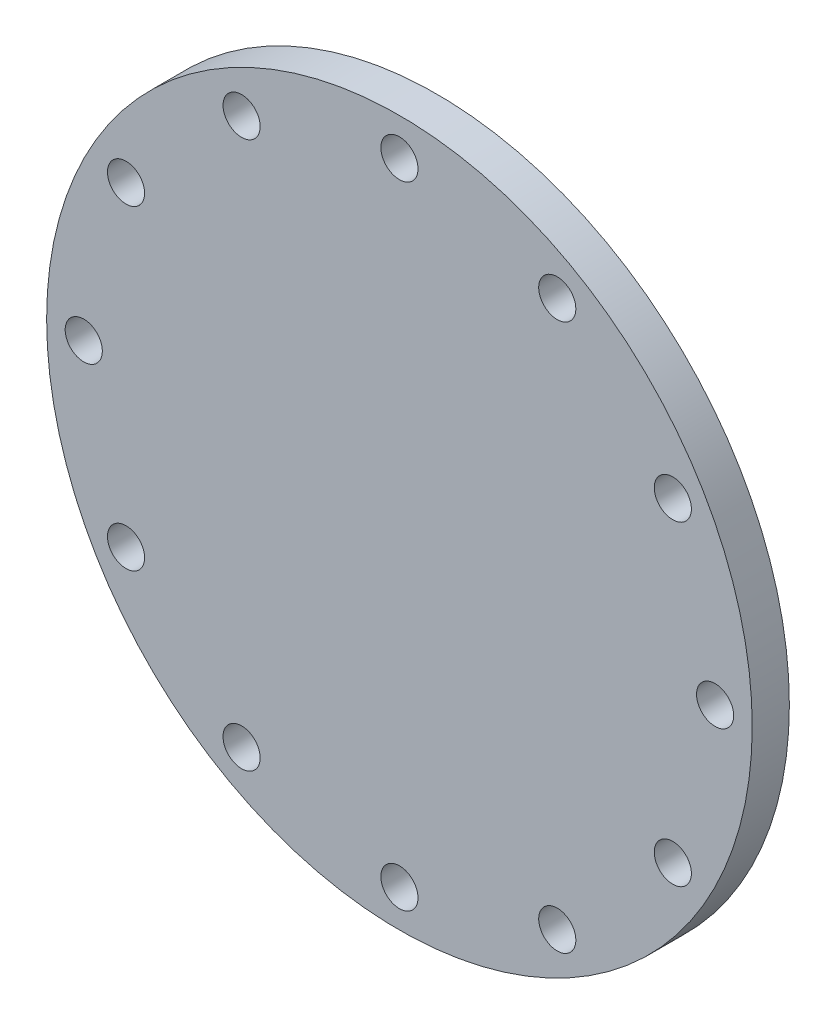
ISO-10303-21;
HEADER;
FILE_DESCRIPTION(('STEP AP214'),'2;1');
FILE_NAME('part.step','',(''),(''),'','','');
FILE_SCHEMA(('AUTOMOTIVE_DESIGN { 1 0 10303 214 1 1 1 1 }'));
ENDSEC;
DATA;
#1=APPLICATION_CONTEXT('core data for automotive mechanical design processes');
#2=APPLICATION_PROTOCOL_DEFINITION('international standard','automotive_design',2000,#1);
#3=PRODUCT_CONTEXT('',#1,'mechanical');
#4=PRODUCT('Part','Part','',(#3));
#5=PRODUCT_RELATED_PRODUCT_CATEGORY('part','',(#4));
#6=PRODUCT_DEFINITION_FORMATION('','',#4);
#7=PRODUCT_DEFINITION_CONTEXT('part definition',#1,'design');
#8=PRODUCT_DEFINITION('design','',#6,#7);
#9=PRODUCT_DEFINITION_SHAPE('','',#8);
#10=(LENGTH_UNIT() NAMED_UNIT(*) SI_UNIT(.MILLI.,.METRE.));
#11=(NAMED_UNIT(*) PLANE_ANGLE_UNIT() SI_UNIT($,.RADIAN.));
#12=(NAMED_UNIT(*) SI_UNIT($,.STERADIAN.) SOLID_ANGLE_UNIT());
#13=UNCERTAINTY_MEASURE_WITH_UNIT(LENGTH_MEASURE(1.E-05),#10,'distance_accuracy_value','');
#14=(GEOMETRIC_REPRESENTATION_CONTEXT(3) GLOBAL_UNCERTAINTY_ASSIGNED_CONTEXT((#13)) GLOBAL_UNIT_ASSIGNED_CONTEXT((#10,
#11,#12)) REPRESENTATION_CONTEXT('',''));
#15=CARTESIAN_POINT('',(0.,0.,0.));
#16=DIRECTION('',(0.,0.,1.));
#17=DIRECTION('',(1.,0.,0.));
#18=AXIS2_PLACEMENT_3D('',#15,#16,#17);
#19=CARTESIAN_POINT('',(0.,0.,25.4));
#20=DIRECTION('',(0.,0.,1.));
#21=DIRECTION('',(1.,0.,0.));
#22=AXIS2_PLACEMENT_3D('',#19,#20,#21);
#23=PLANE('',#22);
#24=CARTESIAN_POINT('',(-186.974884677056,107.949999999992,25.4));
#25=DIRECTION('',(0.,0.,1.));
#26=DIRECTION('',(1.,0.,0.));
#27=AXIS2_PLACEMENT_3D('',#24,#25,#26);
#28=CIRCLE('',#27,12.7000000000093);
#29=CARTESIAN_POINT('',(-174.274884677047,107.949999999992,25.4));
#30=VERTEX_POINT('',#29);
#31=EDGE_CURVE('E103',#30,#30,#28,.T.);
#32=ORIENTED_EDGE('',*,*,#31,.F.);
#33=EDGE_LOOP('',(#32));
#34=FACE_BOUND('',#33,.T.);
#35=CARTESIAN_POINT('',(-186.974884677047,-107.950000000008,25.4));
#36=DIRECTION('',(0.,0.,1.));
#37=DIRECTION('',(1.,0.,0.));
#38=AXIS2_PLACEMENT_3D('',#35,#36,#37);
#39=CIRCLE('',#38,12.7000000000175);
#40=CARTESIAN_POINT('',(-174.274884677029,-107.950000000008,25.4));
#41=VERTEX_POINT('',#40);
#42=EDGE_CURVE('E91',#41,#41,#39,.T.);
#43=ORIENTED_EDGE('',*,*,#42,.F.);
#44=EDGE_LOOP('',(#43));
#45=FACE_BOUND('',#44,.T.);
#46=CARTESIAN_POINT('',(1.83294208248919E-11,-215.9,25.4));
#47=DIRECTION('',(0.,0.,1.));
#48=DIRECTION('',(1.,0.,0.));
#49=AXIS2_PLACEMENT_3D('',#46,#47,#48);
#50=CIRCLE('',#49,12.700000000019);
#51=CARTESIAN_POINT('',(12.7000000000373,-215.9,25.4));
#52=VERTEX_POINT('',#51);
#53=EDGE_CURVE('E79',#52,#52,#50,.T.);
#54=ORIENTED_EDGE('',*,*,#53,.F.);
#55=EDGE_LOOP('',(#54));
#56=FACE_BOUND('',#55,.T.);
#57=CARTESIAN_POINT('',(186.974884677074,-107.949999999992,25.4));
#58=DIRECTION('',(0.,0.,1.));
#59=DIRECTION('',(1.,0.,0.));
#60=AXIS2_PLACEMENT_3D('',#57,#58,#59);
#61=CIRCLE('',#60,12.7000000000118);
#62=CARTESIAN_POINT('',(199.674884677086,-107.949999999992,25.4));
#63=VERTEX_POINT('',#62);
#64=EDGE_CURVE('E67',#63,#63,#61,.T.);
#65=ORIENTED_EDGE('',*,*,#64,.F.);
#66=EDGE_LOOP('',(#65));
#67=FACE_BOUND('',#66,.T.);
#68=CARTESIAN_POINT('',(186.974884677065,107.950000000008,25.4));
#69=DIRECTION('',(0.,0.,1.));
#70=DIRECTION('',(1.,0.,0.));
#71=AXIS2_PLACEMENT_3D('',#68,#69,#70);
#72=CIRCLE('',#71,12.7000000000025);
#73=CARTESIAN_POINT('',(199.674884677067,107.950000000008,25.4));
#74=VERTEX_POINT('',#73);
#75=EDGE_CURVE('E55',#74,#74,#72,.T.);
#76=ORIENTED_EDGE('',*,*,#75,.F.);
#77=EDGE_LOOP('',(#76));
#78=FACE_BOUND('',#77,.T.);
#79=CARTESIAN_POINT('',(0.,215.9,25.4));
#80=DIRECTION('',(0.,0.,1.));
#81=DIRECTION('',(1.,0.,0.));
#82=AXIS2_PLACEMENT_3D('',#79,#80,#81);
#83=CIRCLE('',#82,12.7);
#84=CARTESIAN_POINT('',(12.7,215.9,25.4));
#85=VERTEX_POINT('',#84);
#86=EDGE_CURVE('E44',#85,#85,#83,.T.);
#87=ORIENTED_EDGE('',*,*,#86,.F.);
#88=EDGE_LOOP('',(#87));
#89=FACE_BOUND('',#88,.T.);
#90=CARTESIAN_POINT('',(0.,0.,25.4));
#91=DIRECTION('',(0.,0.,1.));
#92=DIRECTION('',(1.,0.,0.));
#93=AXIS2_PLACEMENT_3D('',#90,#91,#92);
#94=CIRCLE('',#93,241.3);
#95=CARTESIAN_POINT('',(241.3,0.,25.4));
#96=VERTEX_POINT('',#95);
#97=EDGE_CURVE('E10',#96,#96,#94,.T.);
#98=ORIENTED_EDGE('',*,*,#97,.T.);
#99=EDGE_LOOP('',(#98));
#100=FACE_BOUND('',#99,.T.);
#101=CARTESIAN_POINT('',(107.95,186.97488467706,25.4));
#102=DIRECTION('',(0.,0.,1.));
#103=DIRECTION('',(1.,0.,0.));
#104=AXIS2_PLACEMENT_3D('',#101,#102,#103);
#105=CIRCLE('',#104,12.7);
#106=CARTESIAN_POINT('',(120.65,186.97488467706,25.4));
#107=VERTEX_POINT('',#106);
#108=EDGE_CURVE('E49',#107,#107,#105,.T.);
#109=ORIENTED_EDGE('',*,*,#108,.F.);
#110=EDGE_LOOP('',(#109));
#111=FACE_BOUND('',#110,.T.);
#112=CARTESIAN_POINT('',(215.900000000009,9.16471041244595E-12,25.4));
#113=DIRECTION('',(0.,0.,1.));
#114=DIRECTION('',(1.,0.,0.));
#115=AXIS2_PLACEMENT_3D('',#112,#113,#114);
#116=CIRCLE('',#115,12.7000000000068);
#117=CARTESIAN_POINT('',(228.600000000016,9.16471041244595E-12,25.4));
#118=VERTEX_POINT('',#117);
#119=EDGE_CURVE('E61',#118,#118,#116,.T.);
#120=ORIENTED_EDGE('',*,*,#119,.F.);
#121=EDGE_LOOP('',(#120));
#122=FACE_BOUND('',#121,.T.);
#123=CARTESIAN_POINT('',(107.950000000017,-186.974884677056,25.4));
#124=DIRECTION('',(0.,0.,1.));
#125=DIRECTION('',(1.,0.,0.));
#126=AXIS2_PLACEMENT_3D('',#123,#124,#125);
#127=CIRCLE('',#126,12.7000000000163);
#128=CARTESIAN_POINT('',(120.650000000033,-186.974884677056,25.4));
#129=VERTEX_POINT('',#128);
#130=EDGE_CURVE('E73',#129,#129,#127,.T.);
#131=ORIENTED_EDGE('',*,*,#130,.F.);
#132=EDGE_LOOP('',(#131));
#133=FACE_BOUND('',#132,.T.);
#134=CARTESIAN_POINT('',(-107.949999999983,-186.974884677065,25.4));
#135=DIRECTION('',(0.,0.,1.));
#136=DIRECTION('',(1.,0.,0.));
#137=AXIS2_PLACEMENT_3D('',#134,#135,#136);
#138=CIRCLE('',#137,12.7000000000194);
#139=CARTESIAN_POINT('',(-95.2499999999634,-186.974884677065,25.4));
#140=VERTEX_POINT('',#139);
#141=EDGE_CURVE('E85',#140,#140,#138,.T.);
#142=ORIENTED_EDGE('',*,*,#141,.F.);
#143=EDGE_LOOP('',(#142));
#144=FACE_BOUND('',#143,.T.);
#145=CARTESIAN_POINT('',(-215.899999999991,-9.19115053683954E-12,25.4));
#146=DIRECTION('',(0.,0.,1.));
#147=DIRECTION('',(1.,0.,0.));
#148=AXIS2_PLACEMENT_3D('',#145,#146,#147);
#149=CIRCLE('',#148,12.7000000000136);
#150=CARTESIAN_POINT('',(-203.199999999977,-9.19115053683954E-12,25.4));
#151=VERTEX_POINT('',#150);
#152=EDGE_CURVE('E97',#151,#151,#149,.T.);
#153=ORIENTED_EDGE('',*,*,#152,.F.);
#154=EDGE_LOOP('',(#153));
#155=FACE_BOUND('',#154,.T.);
#156=CARTESIAN_POINT('',(-107.949999999999,186.974884677056,25.4));
#157=DIRECTION('',(0.,0.,1.));
#158=DIRECTION('',(1.,0.,0.));
#159=AXIS2_PLACEMENT_3D('',#156,#157,#158);
#160=CIRCLE('',#159,12.7000000000053);
#161=CARTESIAN_POINT('',(-95.2499999999936,186.974884677056,25.4));
#162=VERTEX_POINT('',#161);
#163=EDGE_CURVE('E109',#162,#162,#160,.T.);
#164=ORIENTED_EDGE('',*,*,#163,.F.);
#165=EDGE_LOOP('',(#164));
#166=FACE_BOUND('',#165,.T.);
#167=ADVANCED_FACE('F33',(#34,#45,#56,#67,#78,#89,#100,#111,#122,#133,#144,#155,#166),#23,.T.);
#168=CARTESIAN_POINT('',(0.,0.,0.));
#169=DIRECTION('',(0.,0.,1.));
#170=DIRECTION('',(1.,0.,0.));
#171=AXIS2_PLACEMENT_3D('',#168,#169,#170);
#172=PLANE('',#171);
#173=CARTESIAN_POINT('',(0.,0.,0.));
#174=DIRECTION('',(0.,0.,1.));
#175=DIRECTION('',(1.,0.,0.));
#176=AXIS2_PLACEMENT_3D('',#173,#174,#175);
#177=CIRCLE('',#176,241.3);
#178=CARTESIAN_POINT('',(241.3,0.,0.));
#179=VERTEX_POINT('',#178);
#180=EDGE_CURVE('E37',#179,#179,#177,.T.);
#181=ORIENTED_EDGE('',*,*,#180,.F.);
#182=EDGE_LOOP('',(#181));
#183=FACE_BOUND('',#182,.T.);
#184=CARTESIAN_POINT('',(0.,215.9,0.));
#185=DIRECTION('',(0.,0.,1.));
#186=DIRECTION('',(1.,0.,0.));
#187=AXIS2_PLACEMENT_3D('',#184,#185,#186);
#188=CIRCLE('',#187,12.7);
#189=CARTESIAN_POINT('',(12.7,215.9,0.));
#190=VERTEX_POINT('',#189);
#191=EDGE_CURVE('E46',#190,#190,#188,.T.);
#192=ORIENTED_EDGE('',*,*,#191,.T.);
#193=EDGE_LOOP('',(#192));
#194=FACE_BOUND('',#193,.T.);
#195=CARTESIAN_POINT('',(107.95,186.97488467706,0.));
#196=DIRECTION('',(0.,0.,1.));
#197=DIRECTION('',(1.,0.,0.));
#198=AXIS2_PLACEMENT_3D('',#195,#196,#197);
#199=CIRCLE('',#198,12.7);
#200=CARTESIAN_POINT('',(120.65,186.97488467706,0.));
#201=VERTEX_POINT('',#200);
#202=EDGE_CURVE('E52',#201,#201,#199,.T.);
#203=ORIENTED_EDGE('',*,*,#202,.T.);
#204=EDGE_LOOP('',(#203));
#205=FACE_BOUND('',#204,.T.);
#206=CARTESIAN_POINT('',(186.974884677065,107.950000000008,0.));
#207=DIRECTION('',(0.,0.,1.));
#208=DIRECTION('',(1.,0.,0.));
#209=AXIS2_PLACEMENT_3D('',#206,#207,#208);
#210=CIRCLE('',#209,12.7000000000025);
#211=CARTESIAN_POINT('',(199.674884677067,107.950000000008,0.));
#212=VERTEX_POINT('',#211);
#213=EDGE_CURVE('E58',#212,#212,#210,.T.);
#214=ORIENTED_EDGE('',*,*,#213,.T.);
#215=EDGE_LOOP('',(#214));
#216=FACE_BOUND('',#215,.T.);
#217=CARTESIAN_POINT('',(215.900000000009,9.16471041244595E-12,0.));
#218=DIRECTION('',(0.,0.,1.));
#219=DIRECTION('',(1.,0.,0.));
#220=AXIS2_PLACEMENT_3D('',#217,#218,#219);
#221=CIRCLE('',#220,12.7000000000068);
#222=CARTESIAN_POINT('',(228.600000000016,9.16471041244595E-12,0.));
#223=VERTEX_POINT('',#222);
#224=EDGE_CURVE('E64',#223,#223,#221,.T.);
#225=ORIENTED_EDGE('',*,*,#224,.T.);
#226=EDGE_LOOP('',(#225));
#227=FACE_BOUND('',#226,.T.);
#228=CARTESIAN_POINT('',(186.974884677074,-107.949999999992,0.));
#229=DIRECTION('',(0.,0.,1.));
#230=DIRECTION('',(1.,0.,0.));
#231=AXIS2_PLACEMENT_3D('',#228,#229,#230);
#232=CIRCLE('',#231,12.7000000000118);
#233=CARTESIAN_POINT('',(199.674884677086,-107.949999999992,0.));
#234=VERTEX_POINT('',#233);
#235=EDGE_CURVE('E70',#234,#234,#232,.T.);
#236=ORIENTED_EDGE('',*,*,#235,.T.);
#237=EDGE_LOOP('',(#236));
#238=FACE_BOUND('',#237,.T.);
#239=CARTESIAN_POINT('',(107.950000000017,-186.974884677056,0.));
#240=DIRECTION('',(0.,0.,1.));
#241=DIRECTION('',(1.,0.,0.));
#242=AXIS2_PLACEMENT_3D('',#239,#240,#241);
#243=CIRCLE('',#242,12.7000000000163);
#244=CARTESIAN_POINT('',(120.650000000033,-186.974884677056,0.));
#245=VERTEX_POINT('',#244);
#246=EDGE_CURVE('E76',#245,#245,#243,.T.);
#247=ORIENTED_EDGE('',*,*,#246,.T.);
#248=EDGE_LOOP('',(#247));
#249=FACE_BOUND('',#248,.T.);
#250=CARTESIAN_POINT('',(1.83294208248919E-11,-215.9,0.));
#251=DIRECTION('',(0.,0.,1.));
#252=DIRECTION('',(1.,0.,0.));
#253=AXIS2_PLACEMENT_3D('',#250,#251,#252);
#254=CIRCLE('',#253,12.700000000019);
#255=CARTESIAN_POINT('',(12.7000000000373,-215.9,0.));
#256=VERTEX_POINT('',#255);
#257=EDGE_CURVE('E82',#256,#256,#254,.T.);
#258=ORIENTED_EDGE('',*,*,#257,.T.);
#259=EDGE_LOOP('',(#258));
#260=FACE_BOUND('',#259,.T.);
#261=CARTESIAN_POINT('',(-107.949999999983,-186.974884677065,0.));
#262=DIRECTION('',(0.,0.,1.));
#263=DIRECTION('',(1.,0.,0.));
#264=AXIS2_PLACEMENT_3D('',#261,#262,#263);
#265=CIRCLE('',#264,12.7000000000194);
#266=CARTESIAN_POINT('',(-95.2499999999634,-186.974884677065,0.));
#267=VERTEX_POINT('',#266);
#268=EDGE_CURVE('E88',#267,#267,#265,.T.);
#269=ORIENTED_EDGE('',*,*,#268,.T.);
#270=EDGE_LOOP('',(#269));
#271=FACE_BOUND('',#270,.T.);
#272=CARTESIAN_POINT('',(-186.974884677047,-107.950000000008,0.));
#273=DIRECTION('',(0.,0.,1.));
#274=DIRECTION('',(1.,0.,0.));
#275=AXIS2_PLACEMENT_3D('',#272,#273,#274);
#276=CIRCLE('',#275,12.7000000000175);
#277=CARTESIAN_POINT('',(-174.274884677029,-107.950000000008,0.));
#278=VERTEX_POINT('',#277);
#279=EDGE_CURVE('E94',#278,#278,#276,.T.);
#280=ORIENTED_EDGE('',*,*,#279,.T.);
#281=EDGE_LOOP('',(#280));
#282=FACE_BOUND('',#281,.T.);
#283=CARTESIAN_POINT('',(-215.899999999991,-9.19115053683954E-12,0.));
#284=DIRECTION('',(0.,0.,1.));
#285=DIRECTION('',(1.,0.,0.));
#286=AXIS2_PLACEMENT_3D('',#283,#284,#285);
#287=CIRCLE('',#286,12.7000000000136);
#288=CARTESIAN_POINT('',(-203.199999999977,-9.19115053683954E-12,0.));
#289=VERTEX_POINT('',#288);
#290=EDGE_CURVE('E100',#289,#289,#287,.T.);
#291=ORIENTED_EDGE('',*,*,#290,.T.);
#292=EDGE_LOOP('',(#291));
#293=FACE_BOUND('',#292,.T.);
#294=CARTESIAN_POINT('',(-186.974884677056,107.949999999992,0.));
#295=DIRECTION('',(0.,0.,1.));
#296=DIRECTION('',(1.,0.,0.));
#297=AXIS2_PLACEMENT_3D('',#294,#295,#296);
#298=CIRCLE('',#297,12.7000000000093);
#299=CARTESIAN_POINT('',(-174.274884677047,107.949999999992,0.));
#300=VERTEX_POINT('',#299);
#301=EDGE_CURVE('E106',#300,#300,#298,.T.);
#302=ORIENTED_EDGE('',*,*,#301,.T.);
#303=EDGE_LOOP('',(#302));
#304=FACE_BOUND('',#303,.T.);
#305=CARTESIAN_POINT('',(-107.949999999999,186.974884677056,0.));
#306=DIRECTION('',(0.,0.,1.));
#307=DIRECTION('',(1.,0.,0.));
#308=AXIS2_PLACEMENT_3D('',#305,#306,#307);
#309=CIRCLE('',#308,12.7000000000053);
#310=CARTESIAN_POINT('',(-95.2499999999936,186.974884677056,0.));
#311=VERTEX_POINT('',#310);
#312=EDGE_CURVE('E112',#311,#311,#309,.T.);
#313=ORIENTED_EDGE('',*,*,#312,.T.);
#314=EDGE_LOOP('',(#313));
#315=FACE_BOUND('',#314,.T.);
#316=ADVANCED_FACE('F122',(#183,#194,#205,#216,#227,#238,#249,#260,#271,#282,#293,#304,#315),
#172,.F.);
#317=CARTESIAN_POINT('',(0.,0.,25.4));
#318=DIRECTION('',(0.,0.,-1.));
#319=DIRECTION('',(-1.,0.,0.));
#320=AXIS2_PLACEMENT_3D('',#317,#318,#319);
#321=CYLINDRICAL_SURFACE('',#320,241.3);
#322=ORIENTED_EDGE('',*,*,#97,.F.);
#323=EDGE_LOOP('',(#322));
#324=FACE_BOUND('',#323,.T.);
#325=ORIENTED_EDGE('',*,*,#180,.T.);
#326=EDGE_LOOP('',(#325));
#327=FACE_BOUND('',#326,.T.);
#328=ADVANCED_FACE('F35',(#324,#327),#321,.T.);
#329=CARTESIAN_POINT('',(0.,215.9,25.4));
#330=DIRECTION('',(0.,0.,-1.));
#331=DIRECTION('',(-1.,0.,0.));
#332=AXIS2_PLACEMENT_3D('',#329,#330,#331);
#333=CYLINDRICAL_SURFACE('',#332,12.7);
#334=ORIENTED_EDGE('',*,*,#86,.T.);
#335=EDGE_LOOP('',(#334));
#336=FACE_BOUND('',#335,.T.);
#337=ORIENTED_EDGE('',*,*,#191,.F.);
#338=EDGE_LOOP('',(#337));
#339=FACE_BOUND('',#338,.T.);
#340=ADVANCED_FACE('F132',(#336,#339),#333,.F.);
#341=CARTESIAN_POINT('',(107.95,186.97488467706,25.4));
#342=DIRECTION('',(0.,0.,-1.));
#343=DIRECTION('',(-1.,0.,0.));
#344=AXIS2_PLACEMENT_3D('',#341,#342,#343);
#345=CYLINDRICAL_SURFACE('',#344,12.7);
#346=ORIENTED_EDGE('',*,*,#108,.T.);
#347=EDGE_LOOP('',(#346));
#348=FACE_BOUND('',#347,.T.);
#349=ORIENTED_EDGE('',*,*,#202,.F.);
#350=EDGE_LOOP('',(#349));
#351=FACE_BOUND('',#350,.T.);
#352=ADVANCED_FACE('F135',(#348,#351),#345,.F.);
#353=CARTESIAN_POINT('',(186.974884677065,107.950000000008,25.4));
#354=DIRECTION('',(0.,0.,-1.));
#355=DIRECTION('',(-1.,0.,0.));
#356=AXIS2_PLACEMENT_3D('',#353,#354,#355);
#357=CYLINDRICAL_SURFACE('',#356,12.7000000000025);
#358=ORIENTED_EDGE('',*,*,#75,.T.);
#359=EDGE_LOOP('',(#358));
#360=FACE_BOUND('',#359,.T.);
#361=ORIENTED_EDGE('',*,*,#213,.F.);
#362=EDGE_LOOP('',(#361));
#363=FACE_BOUND('',#362,.T.);
#364=ADVANCED_FACE('F139',(#360,#363),#357,.F.);
#365=CARTESIAN_POINT('',(215.900000000009,9.16471041244595E-12,25.4));
#366=DIRECTION('',(0.,0.,-1.));
#367=DIRECTION('',(-1.,0.,0.));
#368=AXIS2_PLACEMENT_3D('',#365,#366,#367);
#369=CYLINDRICAL_SURFACE('',#368,12.7000000000068);
#370=ORIENTED_EDGE('',*,*,#119,.T.);
#371=EDGE_LOOP('',(#370));
#372=FACE_BOUND('',#371,.T.);
#373=ORIENTED_EDGE('',*,*,#224,.F.);
#374=EDGE_LOOP('',(#373));
#375=FACE_BOUND('',#374,.T.);
#376=ADVANCED_FACE('F143',(#372,#375),#369,.F.);
#377=CARTESIAN_POINT('',(186.974884677074,-107.949999999992,25.4));
#378=DIRECTION('',(0.,0.,-1.));
#379=DIRECTION('',(-1.,0.,0.));
#380=AXIS2_PLACEMENT_3D('',#377,#378,#379);
#381=CYLINDRICAL_SURFACE('',#380,12.7000000000118);
#382=ORIENTED_EDGE('',*,*,#64,.T.);
#383=EDGE_LOOP('',(#382));
#384=FACE_BOUND('',#383,.T.);
#385=ORIENTED_EDGE('',*,*,#235,.F.);
#386=EDGE_LOOP('',(#385));
#387=FACE_BOUND('',#386,.T.);
#388=ADVANCED_FACE('F147',(#384,#387),#381,.F.);
#389=CARTESIAN_POINT('',(107.950000000017,-186.974884677056,25.4));
#390=DIRECTION('',(0.,0.,-1.));
#391=DIRECTION('',(-1.,0.,0.));
#392=AXIS2_PLACEMENT_3D('',#389,#390,#391);
#393=CYLINDRICAL_SURFACE('',#392,12.7000000000163);
#394=ORIENTED_EDGE('',*,*,#130,.T.);
#395=EDGE_LOOP('',(#394));
#396=FACE_BOUND('',#395,.T.);
#397=ORIENTED_EDGE('',*,*,#246,.F.);
#398=EDGE_LOOP('',(#397));
#399=FACE_BOUND('',#398,.T.);
#400=ADVANCED_FACE('F151',(#396,#399),#393,.F.);
#401=CARTESIAN_POINT('',(1.83294208248919E-11,-215.9,25.4));
#402=DIRECTION('',(0.,0.,-1.));
#403=DIRECTION('',(-1.,0.,0.));
#404=AXIS2_PLACEMENT_3D('',#401,#402,#403);
#405=CYLINDRICAL_SURFACE('',#404,12.700000000019);
#406=ORIENTED_EDGE('',*,*,#53,.T.);
#407=EDGE_LOOP('',(#406));
#408=FACE_BOUND('',#407,.T.);
#409=ORIENTED_EDGE('',*,*,#257,.F.);
#410=EDGE_LOOP('',(#409));
#411=FACE_BOUND('',#410,.T.);
#412=ADVANCED_FACE('F155',(#408,#411),#405,.F.);
#413=CARTESIAN_POINT('',(-107.949999999983,-186.974884677065,25.4));
#414=DIRECTION('',(0.,0.,-1.));
#415=DIRECTION('',(-1.,0.,0.));
#416=AXIS2_PLACEMENT_3D('',#413,#414,#415);
#417=CYLINDRICAL_SURFACE('',#416,12.7000000000194);
#418=ORIENTED_EDGE('',*,*,#141,.T.);
#419=EDGE_LOOP('',(#418));
#420=FACE_BOUND('',#419,.T.);
#421=ORIENTED_EDGE('',*,*,#268,.F.);
#422=EDGE_LOOP('',(#421));
#423=FACE_BOUND('',#422,.T.);
#424=ADVANCED_FACE('F159',(#420,#423),#417,.F.);
#425=CARTESIAN_POINT('',(-186.974884677047,-107.950000000008,25.4));
#426=DIRECTION('',(0.,0.,-1.));
#427=DIRECTION('',(-1.,0.,0.));
#428=AXIS2_PLACEMENT_3D('',#425,#426,#427);
#429=CYLINDRICAL_SURFACE('',#428,12.7000000000175);
#430=ORIENTED_EDGE('',*,*,#42,.T.);
#431=EDGE_LOOP('',(#430));
#432=FACE_BOUND('',#431,.T.);
#433=ORIENTED_EDGE('',*,*,#279,.F.);
#434=EDGE_LOOP('',(#433));
#435=FACE_BOUND('',#434,.T.);
#436=ADVANCED_FACE('F163',(#432,#435),#429,.F.);
#437=CARTESIAN_POINT('',(-215.899999999991,-9.19115053683954E-12,25.4));
#438=DIRECTION('',(0.,0.,-1.));
#439=DIRECTION('',(-1.,0.,0.));
#440=AXIS2_PLACEMENT_3D('',#437,#438,#439);
#441=CYLINDRICAL_SURFACE('',#440,12.7000000000136);
#442=ORIENTED_EDGE('',*,*,#152,.T.);
#443=EDGE_LOOP('',(#442));
#444=FACE_BOUND('',#443,.T.);
#445=ORIENTED_EDGE('',*,*,#290,.F.);
#446=EDGE_LOOP('',(#445));
#447=FACE_BOUND('',#446,.T.);
#448=ADVANCED_FACE('F167',(#444,#447),#441,.F.);
#449=CARTESIAN_POINT('',(-186.974884677056,107.949999999992,25.4));
#450=DIRECTION('',(0.,0.,-1.));
#451=DIRECTION('',(-1.,0.,0.));
#452=AXIS2_PLACEMENT_3D('',#449,#450,#451);
#453=CYLINDRICAL_SURFACE('',#452,12.7000000000093);
#454=ORIENTED_EDGE('',*,*,#31,.T.);
#455=EDGE_LOOP('',(#454));
#456=FACE_BOUND('',#455,.T.);
#457=ORIENTED_EDGE('',*,*,#301,.F.);
#458=EDGE_LOOP('',(#457));
#459=FACE_BOUND('',#458,.T.);
#460=ADVANCED_FACE('F171',(#456,#459),#453,.F.);
#461=CARTESIAN_POINT('',(-107.949999999999,186.974884677056,25.4));
#462=DIRECTION('',(0.,0.,-1.));
#463=DIRECTION('',(-1.,0.,0.));
#464=AXIS2_PLACEMENT_3D('',#461,#462,#463);
#465=CYLINDRICAL_SURFACE('',#464,12.7000000000053);
#466=ORIENTED_EDGE('',*,*,#163,.T.);
#467=EDGE_LOOP('',(#466));
#468=FACE_BOUND('',#467,.T.);
#469=ORIENTED_EDGE('',*,*,#312,.F.);
#470=EDGE_LOOP('',(#469));
#471=FACE_BOUND('',#470,.T.);
#472=ADVANCED_FACE('F118',(#468,#471),#465,.F.);
#473=CLOSED_SHELL('',(#167,#316,#328,#340,#352,#364,#376,#388,#400,#412,#424,#436,#448,#460,#472));
#474=MANIFOLD_SOLID_BREP('B2',#473);
#475=ADVANCED_BREP_SHAPE_REPRESENTATION('',(#18,#474),#14);
#476=SHAPE_DEFINITION_REPRESENTATION(#9,#475);
ENDSEC;
END-ISO-10303-21;
